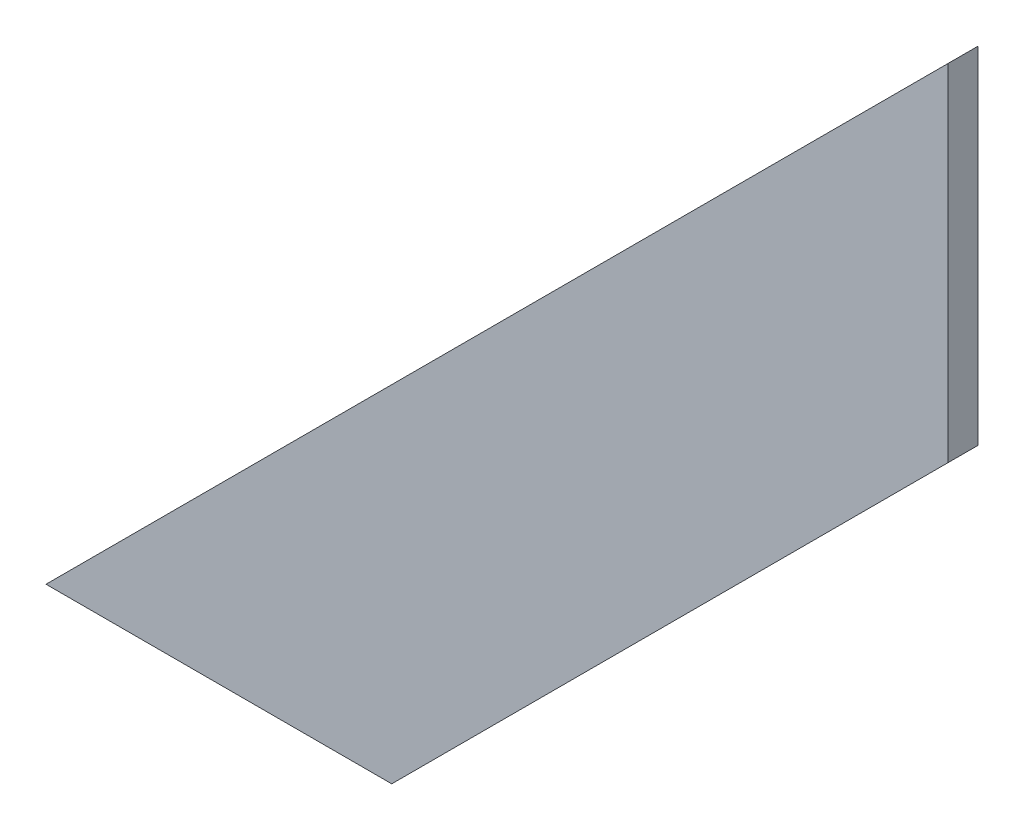
ISO-10303-21;
HEADER;
FILE_DESCRIPTION(('STEP AP214'),'2;1');
FILE_NAME('part.step','',(''),(''),'','','');
FILE_SCHEMA(('AUTOMOTIVE_DESIGN { 1 0 10303 214 1 1 1 1 }'));
ENDSEC;
DATA;
#1=APPLICATION_CONTEXT('core data for automotive mechanical design processes');
#2=APPLICATION_PROTOCOL_DEFINITION('international standard','automotive_design',2000,#1);
#3=PRODUCT_CONTEXT('',#1,'mechanical');
#4=PRODUCT('Part','Part','',(#3));
#5=PRODUCT_RELATED_PRODUCT_CATEGORY('part','',(#4));
#6=PRODUCT_DEFINITION_FORMATION('','',#4);
#7=PRODUCT_DEFINITION_CONTEXT('part definition',#1,'design');
#8=PRODUCT_DEFINITION('design','',#6,#7);
#9=PRODUCT_DEFINITION_SHAPE('','',#8);
#10=(LENGTH_UNIT() NAMED_UNIT(*) SI_UNIT(.MILLI.,.METRE.));
#11=(NAMED_UNIT(*) PLANE_ANGLE_UNIT() SI_UNIT($,.RADIAN.));
#12=(NAMED_UNIT(*) SI_UNIT($,.STERADIAN.) SOLID_ANGLE_UNIT());
#13=UNCERTAINTY_MEASURE_WITH_UNIT(LENGTH_MEASURE(1.E-05),#10,'distance_accuracy_value','');
#14=(GEOMETRIC_REPRESENTATION_CONTEXT(3) GLOBAL_UNCERTAINTY_ASSIGNED_CONTEXT((#13)) GLOBAL_UNIT_ASSIGNED_CONTEXT((#10,
#11,#12)) REPRESENTATION_CONTEXT('',''));
#15=CARTESIAN_POINT('',(0.,0.,0.));
#16=DIRECTION('',(0.,0.,1.));
#17=DIRECTION('',(1.,0.,0.));
#18=AXIS2_PLACEMENT_3D('',#15,#16,#17);
#19=CARTESIAN_POINT('',(23.0000000000001,0.,2.));
#20=DIRECTION('',(0.,1.,0.));
#21=DIRECTION('',(-1.,0.,0.));
#22=AXIS2_PLACEMENT_3D('',#19,#20,#21);
#23=PLANE('',#22);
#24=DIRECTION('',(1.,0.,0.));
#25=VECTOR('',#24,1.);
#26=CARTESIAN_POINT('',(23.0000000000001,0.,0.));
#27=LINE('',#26,#25);
#28=CARTESIAN_POINT('',(0.,0.,0.));
#29=VERTEX_POINT('',#28);
#30=CARTESIAN_POINT('',(23.0000000000001,0.,0.));
#31=VERTEX_POINT('',#30);
#32=EDGE_CURVE('E94',#29,#31,#27,.T.);
#33=ORIENTED_EDGE('',*,*,#32,.T.);
#34=DIRECTION('',(0.,0.,-1.));
#35=VECTOR('',#34,1.);
#36=CARTESIAN_POINT('',(23.0000000000001,0.,2.));
#37=LINE('',#36,#35);
#38=CARTESIAN_POINT('',(23.0000000000001,0.,2.));
#39=VERTEX_POINT('',#38);
#40=EDGE_CURVE('E11',#39,#31,#37,.T.);
#41=ORIENTED_EDGE('',*,*,#40,.F.);
#42=DIRECTION('',(1.,0.,0.));
#43=VECTOR('',#42,1.);
#44=CARTESIAN_POINT('',(23.0000000000001,0.,2.));
#45=LINE('',#44,#43);
#46=CARTESIAN_POINT('',(0.,0.,2.));
#47=VERTEX_POINT('',#46);
#48=EDGE_CURVE('E82',#47,#39,#45,.T.);
#49=ORIENTED_EDGE('',*,*,#48,.F.);
#50=DIRECTION('',(0.,0.,-1.));
#51=VECTOR('',#50,1.);
#52=CARTESIAN_POINT('',(0.,0.,2.));
#53=LINE('',#52,#51);
#54=EDGE_CURVE('E90',#47,#29,#53,.T.);
#55=ORIENTED_EDGE('',*,*,#54,.T.);
#56=EDGE_LOOP('',(#33,#41,#49,#55));
#57=FACE_BOUND('',#56,.T.);
#58=ADVANCED_FACE('F31',(#57),#23,.F.);
#59=CARTESIAN_POINT('',(60.,37.,2.));
#60=DIRECTION('',(-0.707106781186549,0.707106781186546,0.));
#61=DIRECTION('',(-0.707106781186546,-0.707106781186549,0.));
#62=AXIS2_PLACEMENT_3D('',#59,#60,#61);
#63=PLANE('',#62);
#64=DIRECTION('',(0.707106781186546,0.707106781186549,0.));
#65=VECTOR('',#64,1.);
#66=CARTESIAN_POINT('',(60.,37.,0.));
#67=LINE('',#66,#65);
#68=CARTESIAN_POINT('',(60.,37.,0.));
#69=VERTEX_POINT('',#68);
#70=EDGE_CURVE('E86',#31,#69,#67,.T.);
#71=ORIENTED_EDGE('',*,*,#70,.T.);
#72=DIRECTION('',(0.,0.,-1.));
#73=VECTOR('',#72,1.);
#74=CARTESIAN_POINT('',(60.,37.,2.));
#75=LINE('',#74,#73);
#76=CARTESIAN_POINT('',(60.,37.,2.));
#77=VERTEX_POINT('',#76);
#78=EDGE_CURVE('E39',#77,#69,#75,.T.);
#79=ORIENTED_EDGE('',*,*,#78,.F.);
#80=DIRECTION('',(0.707106781186546,0.707106781186549,0.));
#81=VECTOR('',#80,1.);
#82=CARTESIAN_POINT('',(60.,37.,2.));
#83=LINE('',#82,#81);
#84=EDGE_CURVE('E77',#39,#77,#83,.T.);
#85=ORIENTED_EDGE('',*,*,#84,.F.);
#86=ORIENTED_EDGE('',*,*,#40,.T.);
#87=EDGE_LOOP('',(#71,#79,#85,#86));
#88=FACE_BOUND('',#87,.T.);
#89=ADVANCED_FACE('F85',(#88),#63,.F.);
#90=CARTESIAN_POINT('',(60.,60.0000000000002,2.));
#91=DIRECTION('',(-1.,0.,0.));
#92=DIRECTION('',(0.,-1.,0.));
#93=AXIS2_PLACEMENT_3D('',#90,#91,#92);
#94=PLANE('',#93);
#95=DIRECTION('',(0.,1.,0.));
#96=VECTOR('',#95,1.);
#97=CARTESIAN_POINT('',(60.,60.0000000000002,0.));
#98=LINE('',#97,#96);
#99=CARTESIAN_POINT('',(60.,60.0000000000002,0.));
#100=VERTEX_POINT('',#99);
#101=EDGE_CURVE('E64',#69,#100,#98,.T.);
#102=ORIENTED_EDGE('',*,*,#101,.T.);
#103=DIRECTION('',(0.,0.,-1.));
#104=VECTOR('',#103,1.);
#105=CARTESIAN_POINT('',(60.,60.0000000000002,2.));
#106=LINE('',#105,#104);
#107=CARTESIAN_POINT('',(60.,60.0000000000002,2.));
#108=VERTEX_POINT('',#107);
#109=EDGE_CURVE('E87',#108,#100,#106,.T.);
#110=ORIENTED_EDGE('',*,*,#109,.F.);
#111=DIRECTION('',(0.,1.,0.));
#112=VECTOR('',#111,1.);
#113=CARTESIAN_POINT('',(60.,60.0000000000002,2.));
#114=LINE('',#113,#112);
#115=EDGE_CURVE('E80',#77,#108,#114,.T.);
#116=ORIENTED_EDGE('',*,*,#115,.F.);
#117=ORIENTED_EDGE('',*,*,#78,.T.);
#118=EDGE_LOOP('',(#102,#110,#116,#117));
#119=FACE_BOUND('',#118,.T.);
#120=ADVANCED_FACE('F88',(#119),#94,.F.);
#121=CARTESIAN_POINT('',(0.,0.,2.));
#122=DIRECTION('',(0.707106781186549,-0.707106781186546,0.));
#123=DIRECTION('',(0.707106781186546,0.707106781186549,0.));
#124=AXIS2_PLACEMENT_3D('',#121,#122,#123);
#125=PLANE('',#124);
#126=DIRECTION('',(-0.707106781186546,-0.707106781186549,0.));
#127=VECTOR('',#126,1.);
#128=CARTESIAN_POINT('',(0.,0.,0.));
#129=LINE('',#128,#127);
#130=EDGE_CURVE('E70',#100,#29,#129,.T.);
#131=ORIENTED_EDGE('',*,*,#130,.T.);
#132=ORIENTED_EDGE('',*,*,#54,.F.);
#133=DIRECTION('',(-0.707106781186546,-0.707106781186549,0.));
#134=VECTOR('',#133,1.);
#135=CARTESIAN_POINT('',(0.,0.,2.));
#136=LINE('',#135,#134);
#137=EDGE_CURVE('E47',#108,#47,#136,.T.);
#138=ORIENTED_EDGE('',*,*,#137,.F.);
#139=ORIENTED_EDGE('',*,*,#109,.T.);
#140=EDGE_LOOP('',(#131,#132,#138,#139));
#141=FACE_BOUND('',#140,.T.);
#142=ADVANCED_FACE('F101',(#141),#125,.F.);
#143=CARTESIAN_POINT('',(60.,0.,2.));
#144=DIRECTION('',(0.,0.,1.));
#145=DIRECTION('',(1.,0.,0.));
#146=AXIS2_PLACEMENT_3D('',#143,#144,#145);
#147=PLANE('',#146);
#148=ORIENTED_EDGE('',*,*,#48,.T.);
#149=ORIENTED_EDGE('',*,*,#84,.T.);
#150=ORIENTED_EDGE('',*,*,#115,.T.);
#151=ORIENTED_EDGE('',*,*,#137,.T.);
#152=EDGE_LOOP('',(#148,#149,#150,#151));
#153=FACE_BOUND('',#152,.T.);
#154=ADVANCED_FACE('F78',(#153),#147,.T.);
#155=CARTESIAN_POINT('',(60.,0.,0.));
#156=DIRECTION('',(0.,0.,1.));
#157=DIRECTION('',(1.,0.,0.));
#158=AXIS2_PLACEMENT_3D('',#155,#156,#157);
#159=PLANE('',#158);
#160=ORIENTED_EDGE('',*,*,#32,.F.);
#161=ORIENTED_EDGE('',*,*,#130,.F.);
#162=ORIENTED_EDGE('',*,*,#101,.F.);
#163=ORIENTED_EDGE('',*,*,#70,.F.);
#164=EDGE_LOOP('',(#160,#161,#162,#163));
#165=FACE_BOUND('',#164,.T.);
#166=ADVANCED_FACE('F104',(#165),#159,.F.);
#167=CLOSED_SHELL('',(#58,#89,#120,#142,#154,#166));
#168=MANIFOLD_SOLID_BREP('B2',#167);
#169=ADVANCED_BREP_SHAPE_REPRESENTATION('',(#18,#168),#14);
#170=SHAPE_DEFINITION_REPRESENTATION(#9,#169);
ENDSEC;
END-ISO-10303-21;
